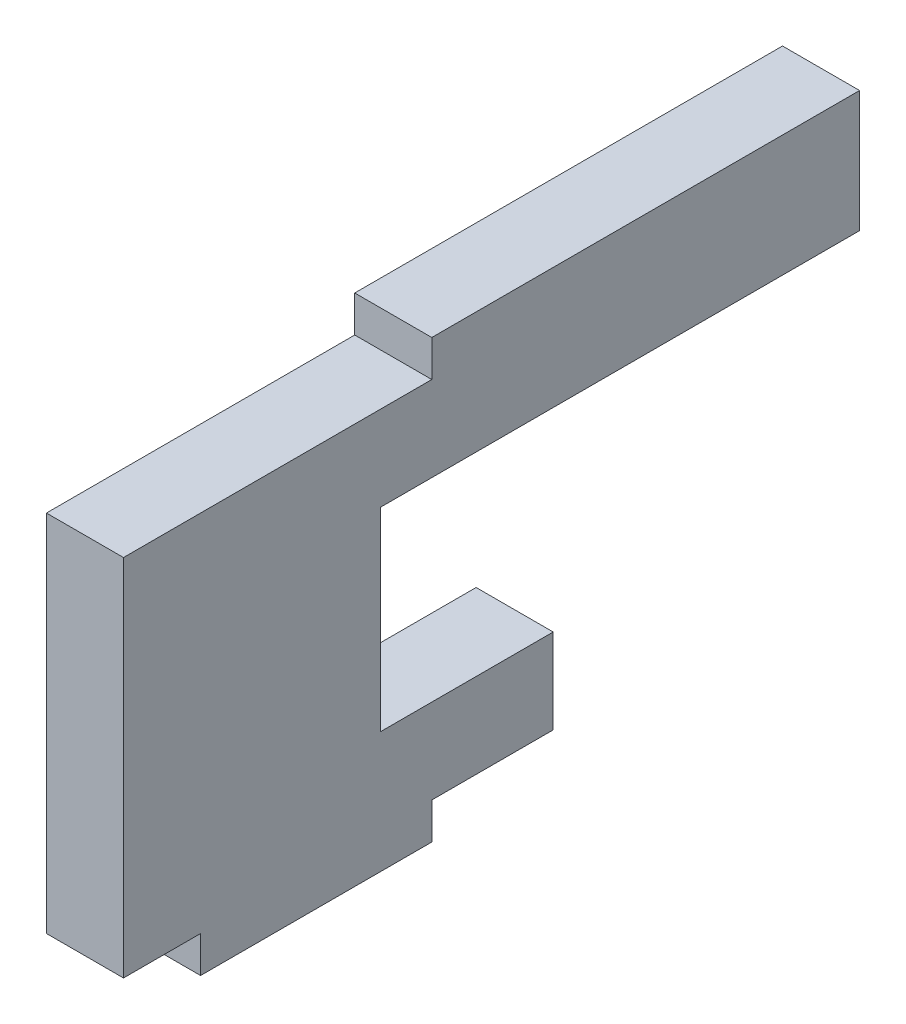
ISO-10303-21;
HEADER;
FILE_DESCRIPTION(('STEP AP214'),'2;1');
FILE_NAME('part.step','',(''),(''),'','','');
FILE_SCHEMA(('AUTOMOTIVE_DESIGN { 1 0 10303 214 1 1 1 1 }'));
ENDSEC;
DATA;
#1=APPLICATION_CONTEXT('core data for automotive mechanical design processes');
#2=APPLICATION_PROTOCOL_DEFINITION('international standard','automotive_design',2000,#1);
#3=PRODUCT_CONTEXT('',#1,'mechanical');
#4=PRODUCT('Part','Part','',(#3));
#5=PRODUCT_RELATED_PRODUCT_CATEGORY('part','',(#4));
#6=PRODUCT_DEFINITION_FORMATION('','',#4);
#7=PRODUCT_DEFINITION_CONTEXT('part definition',#1,'design');
#8=PRODUCT_DEFINITION('design','',#6,#7);
#9=PRODUCT_DEFINITION_SHAPE('','',#8);
#10=(LENGTH_UNIT() NAMED_UNIT(*) SI_UNIT(.MILLI.,.METRE.));
#11=(NAMED_UNIT(*) PLANE_ANGLE_UNIT() SI_UNIT($,.RADIAN.));
#12=(NAMED_UNIT(*) SI_UNIT($,.STERADIAN.) SOLID_ANGLE_UNIT());
#13=UNCERTAINTY_MEASURE_WITH_UNIT(LENGTH_MEASURE(1.E-05),#10,'distance_accuracy_value','');
#14=(GEOMETRIC_REPRESENTATION_CONTEXT(3) GLOBAL_UNCERTAINTY_ASSIGNED_CONTEXT((#13)) GLOBAL_UNIT_ASSIGNED_CONTEXT((#10,
#11,#12)) REPRESENTATION_CONTEXT('',''));
#15=CARTESIAN_POINT('',(0.,0.,0.));
#16=DIRECTION('',(0.,0.,1.));
#17=DIRECTION('',(1.,0.,0.));
#18=AXIS2_PLACEMENT_3D('',#15,#16,#17);
#19=CARTESIAN_POINT('',(3.175,-16.5,0.));
#20=DIRECTION('',(0.,1.,0.));
#21=DIRECTION('',(0.,0.,1.));
#22=AXIS2_PLACEMENT_3D('',#19,#20,#21);
#23=PLANE('',#22);
#24=DIRECTION('',(1.,0.,0.));
#25=VECTOR('',#24,1.);
#26=CARTESIAN_POINT('',(-9.64238689329566,-16.5,-9.525));
#27=LINE('',#26,#25);
#28=CARTESIAN_POINT('',(0.,-16.5,-9.525));
#29=VERTEX_POINT('',#28);
#30=CARTESIAN_POINT('',(3.175,-16.5,-9.525));
#31=VERTEX_POINT('',#30);
#32=EDGE_CURVE('E225',#29,#31,#27,.T.);
#33=ORIENTED_EDGE('',*,*,#32,.F.);
#34=DIRECTION('',(0.,0.,-1.));
#35=VECTOR('',#34,1.);
#36=CARTESIAN_POINT('',(0.,-16.5,0.));
#37=LINE('',#36,#35);
#38=CARTESIAN_POINT('',(0.,-16.5,-14.525));
#39=VERTEX_POINT('',#38);
#40=EDGE_CURVE('E157',#29,#39,#37,.T.);
#41=ORIENTED_EDGE('',*,*,#40,.T.);
#42=DIRECTION('',(1.,0.,0.));
#43=VECTOR('',#42,1.);
#44=CARTESIAN_POINT('',(0.,-16.5,-14.525));
#45=LINE('',#44,#43);
#46=CARTESIAN_POINT('',(3.175,-16.5,-14.525));
#47=VERTEX_POINT('',#46);
#48=EDGE_CURVE('E195',#39,#47,#45,.T.);
#49=ORIENTED_EDGE('',*,*,#48,.T.);
#50=DIRECTION('',(0.,0.,-1.));
#51=VECTOR('',#50,1.);
#52=CARTESIAN_POINT('',(3.175,-16.5,0.));
#53=LINE('',#52,#51);
#54=EDGE_CURVE('E159',#31,#47,#53,.T.);
#55=ORIENTED_EDGE('',*,*,#54,.F.);
#56=EDGE_LOOP('',(#33,#41,#49,#55));
#57=FACE_BOUND('',#56,.T.);
#58=ADVANCED_FACE('F33',(#57),#23,.F.);
#59=CARTESIAN_POINT('',(3.175,0.,0.));
#60=DIRECTION('',(0.,-1.,0.));
#61=DIRECTION('',(0.,0.,-1.));
#62=AXIS2_PLACEMENT_3D('',#59,#60,#61);
#63=PLANE('',#62);
#64=DIRECTION('',(0.,0.,1.));
#65=VECTOR('',#64,1.);
#66=CARTESIAN_POINT('',(3.175,0.,0.));
#67=LINE('',#66,#65);
#68=CARTESIAN_POINT('',(3.175,0.,-27.1457812739693));
#69=VERTEX_POINT('',#68);
#70=CARTESIAN_POINT('',(3.175,0.,-9.525));
#71=VERTEX_POINT('',#70);
#72=EDGE_CURVE('E156',#69,#71,#67,.T.);
#73=ORIENTED_EDGE('',*,*,#72,.F.);
#74=DIRECTION('',(1.,0.,0.));
#75=VECTOR('',#74,1.);
#76=CARTESIAN_POINT('',(-6.825,0.,-27.1457812739693));
#77=LINE('',#76,#75);
#78=CARTESIAN_POINT('',(0.,0.,-27.1457812739693));
#79=VERTEX_POINT('',#78);
#80=EDGE_CURVE('E239',#79,#69,#77,.T.);
#81=ORIENTED_EDGE('',*,*,#80,.F.);
#82=DIRECTION('',(0.,0.,1.));
#83=VECTOR('',#82,1.);
#84=CARTESIAN_POINT('',(0.,0.,0.));
#85=LINE('',#84,#83);
#86=CARTESIAN_POINT('',(0.,0.,-9.525));
#87=VERTEX_POINT('',#86);
#88=EDGE_CURVE('E161',#79,#87,#85,.T.);
#89=ORIENTED_EDGE('',*,*,#88,.T.);
#90=DIRECTION('',(1.,0.,0.));
#91=VECTOR('',#90,1.);
#92=CARTESIAN_POINT('',(-6.825,0.,-9.525));
#93=LINE('',#92,#91);
#94=EDGE_CURVE('E204',#87,#71,#93,.T.);
#95=ORIENTED_EDGE('',*,*,#94,.T.);
#96=EDGE_LOOP('',(#73,#81,#89,#95));
#97=FACE_BOUND('',#96,.T.);
#98=ADVANCED_FACE('F35',(#97),#63,.F.);
#99=CARTESIAN_POINT('',(0.,-16.5,3.175));
#100=VERTEX_POINT('',#99);
#101=CARTESIAN_POINT('',(0.,-16.5,0.));
#102=VERTEX_POINT('',#101);
#103=EDGE_CURVE('E139',#100,#102,#37,.T.);
#104=ORIENTED_EDGE('',*,*,#103,.T.);
#105=DIRECTION('',(1.,0.,0.));
#106=VECTOR('',#105,1.);
#107=CARTESIAN_POINT('',(-9.64238689329566,-16.5,0.));
#108=LINE('',#107,#106);
#109=CARTESIAN_POINT('',(3.175,-16.5,0.));
#110=VERTEX_POINT('',#109);
#111=EDGE_CURVE('E145',#102,#110,#108,.T.);
#112=ORIENTED_EDGE('',*,*,#111,.T.);
#113=CARTESIAN_POINT('',(3.175,-16.5,3.175));
#114=VERTEX_POINT('',#113);
#115=EDGE_CURVE('E168',#114,#110,#53,.T.);
#116=ORIENTED_EDGE('',*,*,#115,.F.);
#117=DIRECTION('',(1.,0.,0.));
#118=VECTOR('',#117,1.);
#119=CARTESIAN_POINT('',(-15.3323391887866,-16.5,3.175));
#120=LINE('',#119,#118);
#121=EDGE_CURVE('E154',#100,#114,#120,.T.);
#122=ORIENTED_EDGE('',*,*,#121,.F.);
#123=EDGE_LOOP('',(#104,#112,#116,#122));
#124=FACE_BOUND('',#123,.T.);
#125=ADVANCED_FACE('F152',(#124),#23,.F.);
#126=CARTESIAN_POINT('',(3.175,0.,0.));
#127=DIRECTION('',(-1.,0.,0.));
#128=DIRECTION('',(0.,0.,1.));
#129=AXIS2_PLACEMENT_3D('',#126,#127,#128);
#130=PLANE('',#129);
#131=DIRECTION('',(0.,0.,1.));
#132=VECTOR('',#131,1.);
#133=CARTESIAN_POINT('',(3.175,-5.,-14.525));
#134=LINE('',#133,#132);
#135=CARTESIAN_POINT('',(3.175,-5.,-27.1457812739693));
#136=VERTEX_POINT('',#135);
#137=CARTESIAN_POINT('',(3.175,-5.,-7.41865052678038));
#138=VERTEX_POINT('',#137);
#139=EDGE_CURVE('E175',#136,#138,#134,.T.);
#140=ORIENTED_EDGE('',*,*,#139,.F.);
#141=DIRECTION('',(0.,-1.,0.));
#142=VECTOR('',#141,1.);
#143=CARTESIAN_POINT('',(3.175,0.,-27.1457812739693));
#144=LINE('',#143,#142);
#145=EDGE_CURVE('E56',#69,#136,#144,.T.);
#146=ORIENTED_EDGE('',*,*,#145,.F.);
#147=ORIENTED_EDGE('',*,*,#72,.T.);
#148=DIRECTION('',(0.,1.,0.));
#149=VECTOR('',#148,1.);
#150=CARTESIAN_POINT('',(3.175,0.,-9.525));
#151=LINE('',#150,#149);
#152=CARTESIAN_POINT('',(3.175,-1.5,-9.525));
#153=VERTEX_POINT('',#152);
#154=EDGE_CURVE('E198',#153,#71,#151,.T.);
#155=ORIENTED_EDGE('',*,*,#154,.F.);
#156=DIRECTION('',(0.,0.,-1.));
#157=VECTOR('',#156,1.);
#158=CARTESIAN_POINT('',(3.175,-1.5,0.));
#159=LINE('',#158,#157);
#160=CARTESIAN_POINT('',(3.175,-1.5,3.175));
#161=VERTEX_POINT('',#160);
#162=EDGE_CURVE('E201',#161,#153,#159,.T.);
#163=ORIENTED_EDGE('',*,*,#162,.F.);
#164=DIRECTION('',(0.,-1.,0.));
#165=VECTOR('',#164,1.);
#166=CARTESIAN_POINT('',(3.175,-16.5,3.175));
#167=LINE('',#166,#165);
#168=EDGE_CURVE('E232',#161,#114,#167,.T.);
#169=ORIENTED_EDGE('',*,*,#168,.T.);
#170=ORIENTED_EDGE('',*,*,#115,.T.);
#171=DIRECTION('',(0.,-1.,0.));
#172=VECTOR('',#171,1.);
#173=CARTESIAN_POINT('',(3.175,-16.5,0.));
#174=LINE('',#173,#172);
#175=CARTESIAN_POINT('',(3.175,-18.,0.));
#176=VERTEX_POINT('',#175);
#177=EDGE_CURVE('E48',#110,#176,#174,.T.);
#178=ORIENTED_EDGE('',*,*,#177,.T.);
#179=DIRECTION('',(0.,0.,-1.));
#180=VECTOR('',#179,1.);
#181=CARTESIAN_POINT('',(3.175,-18.,0.));
#182=LINE('',#181,#180);
#183=CARTESIAN_POINT('',(3.175,-18.,-9.525));
#184=VERTEX_POINT('',#183);
#185=EDGE_CURVE('E150',#176,#184,#182,.T.);
#186=ORIENTED_EDGE('',*,*,#185,.T.);
#187=DIRECTION('',(0.,1.,0.));
#188=VECTOR('',#187,1.);
#189=CARTESIAN_POINT('',(3.175,-18.,-9.525));
#190=LINE('',#189,#188);
#191=EDGE_CURVE('E214',#184,#31,#190,.T.);
#192=ORIENTED_EDGE('',*,*,#191,.T.);
#193=ORIENTED_EDGE('',*,*,#54,.T.);
#194=DIRECTION('',(0.,-1.,0.));
#195=VECTOR('',#194,1.);
#196=CARTESIAN_POINT('',(3.175,-16.5,-14.525));
#197=LINE('',#196,#195);
#198=CARTESIAN_POINT('',(3.175,-13.0064304134889,-14.525));
#199=VERTEX_POINT('',#198);
#200=EDGE_CURVE('E185',#199,#47,#197,.T.);
#201=ORIENTED_EDGE('',*,*,#200,.F.);
#202=DIRECTION('',(0.,0.,-1.));
#203=VECTOR('',#202,1.);
#204=CARTESIAN_POINT('',(3.175,-13.0064304134889,-14.525));
#205=LINE('',#204,#203);
#206=CARTESIAN_POINT('',(3.175,-13.0064304134889,-7.41865052678038));
#207=VERTEX_POINT('',#206);
#208=EDGE_CURVE('E243',#207,#199,#205,.T.);
#209=ORIENTED_EDGE('',*,*,#208,.F.);
#210=DIRECTION('',(0.,-1.,0.));
#211=VECTOR('',#210,1.);
#212=CARTESIAN_POINT('',(3.175,-5.,-7.41865052678038));
#213=LINE('',#212,#211);
#214=EDGE_CURVE('E184',#138,#207,#213,.T.);
#215=ORIENTED_EDGE('',*,*,#214,.F.);
#216=EDGE_LOOP('',(#140,#146,#147,#155,#163,#169,#170,#178,#186,#192,#193,#201,#209,#215));
#217=FACE_BOUND('',#216,.T.);
#218=ADVANCED_FACE('F180',(#217),#130,.F.);
#219=CARTESIAN_POINT('',(0.,0.,0.));
#220=DIRECTION('',(-1.,0.,0.));
#221=DIRECTION('',(0.,0.,1.));
#222=AXIS2_PLACEMENT_3D('',#219,#220,#221);
#223=PLANE('',#222);
#224=DIRECTION('',(0.,1.,0.));
#225=VECTOR('',#224,1.);
#226=CARTESIAN_POINT('',(0.,0.,-27.1457812739693));
#227=LINE('',#226,#225);
#228=CARTESIAN_POINT('',(0.,-5.,-27.1457812739693));
#229=VERTEX_POINT('',#228);
#230=EDGE_CURVE('E237',#229,#79,#227,.T.);
#231=ORIENTED_EDGE('',*,*,#230,.F.);
#232=DIRECTION('',(0.,0.,1.));
#233=VECTOR('',#232,1.);
#234=CARTESIAN_POINT('',(0.,-5.,-14.525));
#235=LINE('',#234,#233);
#236=CARTESIAN_POINT('',(0.,-5.,-7.41865052678038));
#237=VERTEX_POINT('',#236);
#238=EDGE_CURVE('E177',#229,#237,#235,.T.);
#239=ORIENTED_EDGE('',*,*,#238,.T.);
#240=DIRECTION('',(0.,1.,0.));
#241=VECTOR('',#240,1.);
#242=CARTESIAN_POINT('',(0.,0.,-7.41865052678037));
#243=LINE('',#242,#241);
#244=CARTESIAN_POINT('',(0.,-13.0064304134889,-7.41865052678038));
#245=VERTEX_POINT('',#244);
#246=EDGE_CURVE('E11',#245,#237,#243,.T.);
#247=ORIENTED_EDGE('',*,*,#246,.F.);
#248=DIRECTION('',(0.,0.,1.));
#249=VECTOR('',#248,1.);
#250=CARTESIAN_POINT('',(0.,-13.0064304134889,0.));
#251=LINE('',#250,#249);
#252=CARTESIAN_POINT('',(0.,-13.0064304134889,-14.525));
#253=VERTEX_POINT('',#252);
#254=EDGE_CURVE('E228',#253,#245,#251,.T.);
#255=ORIENTED_EDGE('',*,*,#254,.F.);
#256=DIRECTION('',(0.,-1.,0.));
#257=VECTOR('',#256,1.);
#258=CARTESIAN_POINT('',(0.,-16.5,-14.525));
#259=LINE('',#258,#257);
#260=EDGE_CURVE('E192',#253,#39,#259,.T.);
#261=ORIENTED_EDGE('',*,*,#260,.T.);
#262=ORIENTED_EDGE('',*,*,#40,.F.);
#263=DIRECTION('',(0.,1.,0.));
#264=VECTOR('',#263,1.);
#265=CARTESIAN_POINT('',(0.,-18.,-9.525));
#266=LINE('',#265,#264);
#267=CARTESIAN_POINT('',(0.,-18.,-9.525));
#268=VERTEX_POINT('',#267);
#269=EDGE_CURVE('E250',#268,#29,#266,.T.);
#270=ORIENTED_EDGE('',*,*,#269,.F.);
#271=DIRECTION('',(0.,0.,-1.));
#272=VECTOR('',#271,1.);
#273=CARTESIAN_POINT('',(0.,-18.,0.));
#274=LINE('',#273,#272);
#275=CARTESIAN_POINT('',(0.,-18.,0.));
#276=VERTEX_POINT('',#275);
#277=EDGE_CURVE('E142',#276,#268,#274,.T.);
#278=ORIENTED_EDGE('',*,*,#277,.F.);
#279=DIRECTION('',(0.,-1.,0.));
#280=VECTOR('',#279,1.);
#281=CARTESIAN_POINT('',(0.,-16.5,0.));
#282=LINE('',#281,#280);
#283=EDGE_CURVE('E134',#102,#276,#282,.T.);
#284=ORIENTED_EDGE('',*,*,#283,.F.);
#285=ORIENTED_EDGE('',*,*,#103,.F.);
#286=DIRECTION('',(0.,-1.,0.));
#287=VECTOR('',#286,1.);
#288=CARTESIAN_POINT('',(0.,-16.5,3.175));
#289=LINE('',#288,#287);
#290=CARTESIAN_POINT('',(0.,-1.5,3.175));
#291=VERTEX_POINT('',#290);
#292=EDGE_CURVE('E189',#291,#100,#289,.T.);
#293=ORIENTED_EDGE('',*,*,#292,.F.);
#294=DIRECTION('',(0.,0.,1.));
#295=VECTOR('',#294,1.);
#296=CARTESIAN_POINT('',(0.,-1.5,0.));
#297=LINE('',#296,#295);
#298=CARTESIAN_POINT('',(0.,-1.5,-9.525));
#299=VERTEX_POINT('',#298);
#300=EDGE_CURVE('E165',#299,#291,#297,.T.);
#301=ORIENTED_EDGE('',*,*,#300,.F.);
#302=DIRECTION('',(0.,-1.,0.));
#303=VECTOR('',#302,1.);
#304=CARTESIAN_POINT('',(0.,0.,-9.525));
#305=LINE('',#304,#303);
#306=EDGE_CURVE('E167',#87,#299,#305,.T.);
#307=ORIENTED_EDGE('',*,*,#306,.F.);
#308=ORIENTED_EDGE('',*,*,#88,.F.);
#309=EDGE_LOOP('',(#231,#239,#247,#255,#261,#262,#270,#278,#284,#285,#293,#301,#307,#308));
#310=FACE_BOUND('',#309,.T.);
#311=ADVANCED_FACE('F136',(#310),#223,.T.);
#312=CARTESIAN_POINT('',(-6.825,0.,-9.525));
#313=DIRECTION('',(0.,0.,-1.));
#314=DIRECTION('',(-1.,0.,0.));
#315=AXIS2_PLACEMENT_3D('',#312,#313,#314);
#316=PLANE('',#315);
#317=ORIENTED_EDGE('',*,*,#306,.T.);
#318=DIRECTION('',(1.,0.,0.));
#319=VECTOR('',#318,1.);
#320=CARTESIAN_POINT('',(-6.825,-1.5,-9.525));
#321=LINE('',#320,#319);
#322=EDGE_CURVE('E205',#299,#153,#321,.T.);
#323=ORIENTED_EDGE('',*,*,#322,.T.);
#324=ORIENTED_EDGE('',*,*,#154,.T.);
#325=ORIENTED_EDGE('',*,*,#94,.F.);
#326=EDGE_LOOP('',(#317,#323,#324,#325));
#327=FACE_BOUND('',#326,.T.);
#328=ADVANCED_FACE('F286',(#327),#316,.F.);
#329=CARTESIAN_POINT('',(-6.825,-1.5,0.));
#330=DIRECTION('',(0.,-1.,0.));
#331=DIRECTION('',(0.,0.,-1.));
#332=AXIS2_PLACEMENT_3D('',#329,#330,#331);
#333=PLANE('',#332);
#334=ORIENTED_EDGE('',*,*,#300,.T.);
#335=DIRECTION('',(1.,0.,0.));
#336=VECTOR('',#335,1.);
#337=CARTESIAN_POINT('',(-15.3323391887866,-1.5,3.175));
#338=LINE('',#337,#336);
#339=EDGE_CURVE('E230',#291,#161,#338,.T.);
#340=ORIENTED_EDGE('',*,*,#339,.T.);
#341=ORIENTED_EDGE('',*,*,#162,.T.);
#342=ORIENTED_EDGE('',*,*,#322,.F.);
#343=EDGE_LOOP('',(#334,#340,#341,#342));
#344=FACE_BOUND('',#343,.T.);
#345=ADVANCED_FACE('F290',(#344),#333,.F.);
#346=CARTESIAN_POINT('',(0.,-16.5,-14.525));
#347=DIRECTION('',(0.,0.,1.));
#348=DIRECTION('',(1.,0.,0.));
#349=AXIS2_PLACEMENT_3D('',#346,#347,#348);
#350=PLANE('',#349);
#351=ORIENTED_EDGE('',*,*,#260,.F.);
#352=DIRECTION('',(1.,0.,0.));
#353=VECTOR('',#352,1.);
#354=CARTESIAN_POINT('',(-6.825,-13.0064304134889,-14.525));
#355=LINE('',#354,#353);
#356=EDGE_CURVE('E222',#253,#199,#355,.T.);
#357=ORIENTED_EDGE('',*,*,#356,.T.);
#358=ORIENTED_EDGE('',*,*,#200,.T.);
#359=ORIENTED_EDGE('',*,*,#48,.F.);
#360=EDGE_LOOP('',(#351,#357,#358,#359));
#361=FACE_BOUND('',#360,.T.);
#362=ADVANCED_FACE('F221',(#361),#350,.F.);
#363=CARTESIAN_POINT('',(0.,-5.,-14.525));
#364=DIRECTION('',(0.,1.,0.));
#365=DIRECTION('',(0.,0.,1.));
#366=AXIS2_PLACEMENT_3D('',#363,#364,#365);
#367=PLANE('',#366);
#368=ORIENTED_EDGE('',*,*,#238,.F.);
#369=DIRECTION('',(1.,0.,0.));
#370=VECTOR('',#369,1.);
#371=CARTESIAN_POINT('',(0.,-5.,-27.1457812739693));
#372=LINE('',#371,#370);
#373=EDGE_CURVE('E41',#229,#136,#372,.T.);
#374=ORIENTED_EDGE('',*,*,#373,.T.);
#375=ORIENTED_EDGE('',*,*,#139,.T.);
#376=DIRECTION('',(1.,0.,0.));
#377=VECTOR('',#376,1.);
#378=CARTESIAN_POINT('',(-6.825,-5.,-7.41865052678038));
#379=LINE('',#378,#377);
#380=EDGE_CURVE('E240',#237,#138,#379,.T.);
#381=ORIENTED_EDGE('',*,*,#380,.F.);
#382=EDGE_LOOP('',(#368,#374,#375,#381));
#383=FACE_BOUND('',#382,.T.);
#384=ADVANCED_FACE('F173',(#383),#367,.F.);
#385=CARTESIAN_POINT('',(-15.3323391887866,-16.5,3.175));
#386=DIRECTION('',(0.,0.,1.));
#387=DIRECTION('',(1.,0.,0.));
#388=AXIS2_PLACEMENT_3D('',#385,#386,#387);
#389=PLANE('',#388);
#390=ORIENTED_EDGE('',*,*,#339,.F.);
#391=ORIENTED_EDGE('',*,*,#292,.T.);
#392=ORIENTED_EDGE('',*,*,#121,.T.);
#393=ORIENTED_EDGE('',*,*,#168,.F.);
#394=EDGE_LOOP('',(#390,#391,#392,#393));
#395=FACE_BOUND('',#394,.T.);
#396=ADVANCED_FACE('F297',(#395),#389,.T.);
#397=CARTESIAN_POINT('',(-6.825,-13.0064304134889,-14.525));
#398=DIRECTION('',(0.,-1.,0.));
#399=DIRECTION('',(0.,0.,-1.));
#400=AXIS2_PLACEMENT_3D('',#397,#398,#399);
#401=PLANE('',#400);
#402=ORIENTED_EDGE('',*,*,#254,.T.);
#403=DIRECTION('',(1.,0.,0.));
#404=VECTOR('',#403,1.);
#405=CARTESIAN_POINT('',(-6.825,-13.0064304134889,-7.41865052678038));
#406=LINE('',#405,#404);
#407=EDGE_CURVE('E242',#245,#207,#406,.T.);
#408=ORIENTED_EDGE('',*,*,#407,.T.);
#409=ORIENTED_EDGE('',*,*,#208,.T.);
#410=ORIENTED_EDGE('',*,*,#356,.F.);
#411=EDGE_LOOP('',(#402,#408,#409,#410));
#412=FACE_BOUND('',#411,.T.);
#413=ADVANCED_FACE('F302',(#412),#401,.F.);
#414=CARTESIAN_POINT('',(-6.825,-5.,-7.41865052678038));
#415=DIRECTION('',(0.,0.,1.));
#416=DIRECTION('',(0.,-1.,0.));
#417=AXIS2_PLACEMENT_3D('',#414,#415,#416);
#418=PLANE('',#417);
#419=ORIENTED_EDGE('',*,*,#246,.T.);
#420=ORIENTED_EDGE('',*,*,#380,.T.);
#421=ORIENTED_EDGE('',*,*,#214,.T.);
#422=ORIENTED_EDGE('',*,*,#407,.F.);
#423=EDGE_LOOP('',(#419,#420,#421,#422));
#424=FACE_BOUND('',#423,.T.);
#425=ADVANCED_FACE('F304',(#424),#418,.F.);
#426=CARTESIAN_POINT('',(-6.825,0.,-27.1457812739693));
#427=DIRECTION('',(0.,0.,1.));
#428=DIRECTION('',(1.,0.,0.));
#429=AXIS2_PLACEMENT_3D('',#426,#427,#428);
#430=PLANE('',#429);
#431=ORIENTED_EDGE('',*,*,#230,.T.);
#432=ORIENTED_EDGE('',*,*,#80,.T.);
#433=ORIENTED_EDGE('',*,*,#145,.T.);
#434=ORIENTED_EDGE('',*,*,#373,.F.);
#435=EDGE_LOOP('',(#431,#432,#433,#434));
#436=FACE_BOUND('',#435,.T.);
#437=ADVANCED_FACE('F307',(#436),#430,.F.);
#438=CARTESIAN_POINT('',(-9.64238689329566,-16.5,0.));
#439=DIRECTION('',(0.,0.,1.));
#440=DIRECTION('',(1.,0.,0.));
#441=AXIS2_PLACEMENT_3D('',#438,#439,#440);
#442=PLANE('',#441);
#443=ORIENTED_EDGE('',*,*,#111,.F.);
#444=ORIENTED_EDGE('',*,*,#283,.T.);
#445=DIRECTION('',(1.,0.,0.));
#446=VECTOR('',#445,1.);
#447=CARTESIAN_POINT('',(-9.64238689329566,-18.,0.));
#448=LINE('',#447,#446);
#449=EDGE_CURVE('E144',#276,#176,#448,.T.);
#450=ORIENTED_EDGE('',*,*,#449,.T.);
#451=ORIENTED_EDGE('',*,*,#177,.F.);
#452=EDGE_LOOP('',(#443,#444,#450,#451));
#453=FACE_BOUND('',#452,.T.);
#454=ADVANCED_FACE('F147',(#453),#442,.T.);
#455=CARTESIAN_POINT('',(-9.64238689329566,-18.,0.));
#456=DIRECTION('',(0.,-1.,0.));
#457=DIRECTION('',(0.,0.,-1.));
#458=AXIS2_PLACEMENT_3D('',#455,#456,#457);
#459=PLANE('',#458);
#460=ORIENTED_EDGE('',*,*,#449,.F.);
#461=ORIENTED_EDGE('',*,*,#277,.T.);
#462=DIRECTION('',(1.,0.,0.));
#463=VECTOR('',#462,1.);
#464=CARTESIAN_POINT('',(-9.64238689329566,-18.,-9.525));
#465=LINE('',#464,#463);
#466=EDGE_CURVE('E253',#268,#184,#465,.T.);
#467=ORIENTED_EDGE('',*,*,#466,.T.);
#468=ORIENTED_EDGE('',*,*,#185,.F.);
#469=EDGE_LOOP('',(#460,#461,#467,#468));
#470=FACE_BOUND('',#469,.T.);
#471=ADVANCED_FACE('F261',(#470),#459,.T.);
#472=CARTESIAN_POINT('',(-9.64238689329566,-18.,-9.525));
#473=DIRECTION('',(0.,0.,-1.));
#474=DIRECTION('',(-1.,0.,0.));
#475=AXIS2_PLACEMENT_3D('',#472,#473,#474);
#476=PLANE('',#475);
#477=ORIENTED_EDGE('',*,*,#466,.F.);
#478=ORIENTED_EDGE('',*,*,#269,.T.);
#479=ORIENTED_EDGE('',*,*,#32,.T.);
#480=ORIENTED_EDGE('',*,*,#191,.F.);
#481=EDGE_LOOP('',(#477,#478,#479,#480));
#482=FACE_BOUND('',#481,.T.);
#483=ADVANCED_FACE('F264',(#482),#476,.T.);
#484=CLOSED_SHELL('',(#58,#98,#125,#218,#311,#328,#345,#362,#384,#396,#413,#425,#437,#454,#471,#483));
#485=MANIFOLD_SOLID_BREP('B2',#484);
#486=ADVANCED_BREP_SHAPE_REPRESENTATION('',(#18,#485),#14);
#487=SHAPE_DEFINITION_REPRESENTATION(#9,#486);
ENDSEC;
END-ISO-10303-21;
